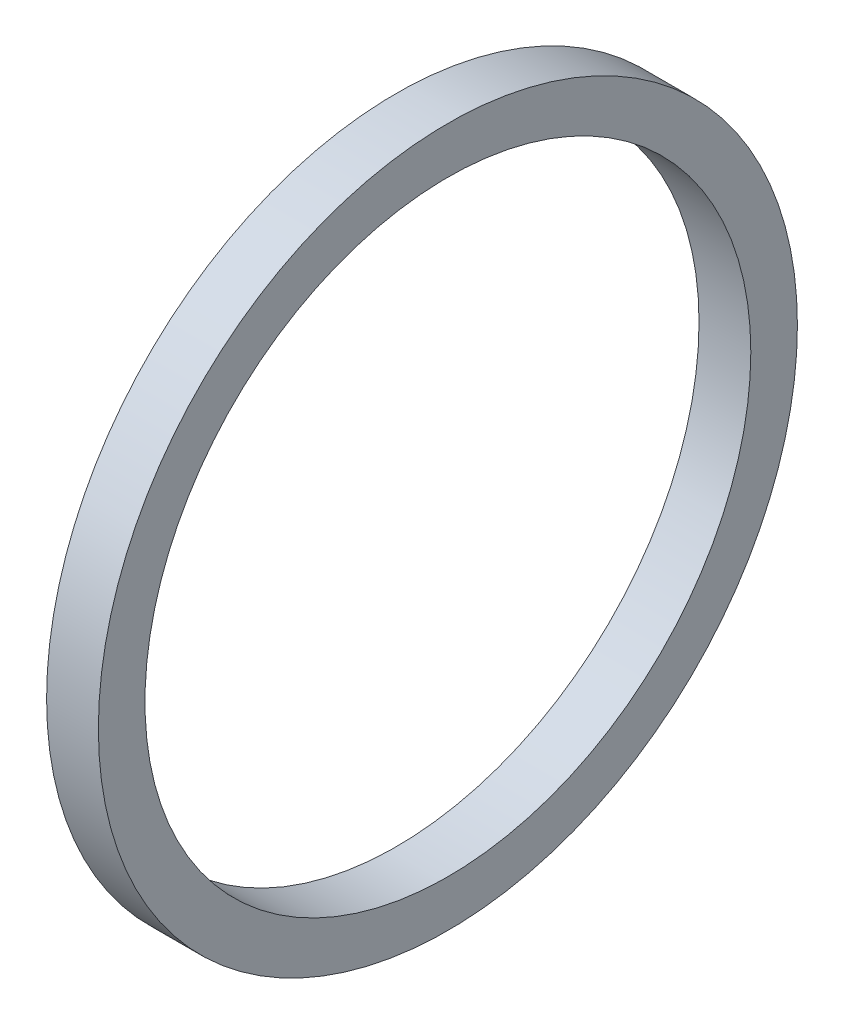
ISO-10303-21;
HEADER;
FILE_DESCRIPTION(('STEP AP214'),'2;1');
FILE_NAME('part.step','',(''),(''),'','','');
FILE_SCHEMA(('AUTOMOTIVE_DESIGN { 1 0 10303 214 1 1 1 1 }'));
ENDSEC;
DATA;
#1=APPLICATION_CONTEXT('core data for automotive mechanical design processes');
#2=APPLICATION_PROTOCOL_DEFINITION('international standard','automotive_design',2000,#1);
#3=PRODUCT_CONTEXT('',#1,'mechanical');
#4=PRODUCT('Part','Part','',(#3));
#5=PRODUCT_RELATED_PRODUCT_CATEGORY('part','',(#4));
#6=PRODUCT_DEFINITION_FORMATION('','',#4);
#7=PRODUCT_DEFINITION_CONTEXT('part definition',#1,'design');
#8=PRODUCT_DEFINITION('design','',#6,#7);
#9=PRODUCT_DEFINITION_SHAPE('','',#8);
#10=(LENGTH_UNIT() NAMED_UNIT(*) SI_UNIT(.MILLI.,.METRE.));
#11=(NAMED_UNIT(*) PLANE_ANGLE_UNIT() SI_UNIT($,.RADIAN.));
#12=(NAMED_UNIT(*) SI_UNIT($,.STERADIAN.) SOLID_ANGLE_UNIT());
#13=UNCERTAINTY_MEASURE_WITH_UNIT(LENGTH_MEASURE(1.E-05),#10,'distance_accuracy_value','');
#14=(GEOMETRIC_REPRESENTATION_CONTEXT(3) GLOBAL_UNCERTAINTY_ASSIGNED_CONTEXT((#13)) GLOBAL_UNIT_ASSIGNED_CONTEXT((#10,
#11,#12)) REPRESENTATION_CONTEXT('',''));
#15=CARTESIAN_POINT('',(0.,0.,0.));
#16=DIRECTION('',(0.,0.,1.));
#17=DIRECTION('',(1.,0.,0.));
#18=AXIS2_PLACEMENT_3D('',#15,#16,#17);
#19=CARTESIAN_POINT('',(0.254,0.156651527152158,1.47761940601797));
#20=DIRECTION('',(1.,0.,0.));
#21=DIRECTION('',(0.,0.,-1.));
#22=AXIS2_PLACEMENT_3D('',#19,#20,#21);
#23=PLANE('',#22);
#24=CARTESIAN_POINT('',(0.254,0.156651527152158,1.47761940601797));
#25=DIRECTION('',(1.,0.,0.));
#26=DIRECTION('',(0.,0.,-1.));
#27=AXIS2_PLACEMENT_3D('',#24,#25,#26);
#28=CIRCLE('',#27,1.7145);
#29=CARTESIAN_POINT('',(0.254,0.156651527152158,-0.236880593982031));
#30=VERTEX_POINT('',#29);
#31=EDGE_CURVE('E10',#30,#30,#28,.T.);
#32=ORIENTED_EDGE('',*,*,#31,.T.);
#33=EDGE_LOOP('',(#32));
#34=FACE_BOUND('',#33,.T.);
#35=CARTESIAN_POINT('',(0.254,0.156651527152158,1.47761940601797));
#36=DIRECTION('',(1.,0.,0.));
#37=DIRECTION('',(0.,0.,-1.));
#38=AXIS2_PLACEMENT_3D('',#35,#36,#37);
#39=CIRCLE('',#38,1.4859);
#40=CARTESIAN_POINT('',(0.254,0.156651527152158,-0.00828059398202984));
#41=VERTEX_POINT('',#40);
#42=EDGE_CURVE('E39',#41,#41,#39,.T.);
#43=ORIENTED_EDGE('',*,*,#42,.F.);
#44=EDGE_LOOP('',(#43));
#45=FACE_BOUND('',#44,.T.);
#46=ADVANCED_FACE('F28',(#34,#45),#23,.T.);
#47=CARTESIAN_POINT('',(0.,0.156651527152158,1.47761940601797));
#48=DIRECTION('',(1.,0.,0.));
#49=DIRECTION('',(0.,0.,-1.));
#50=AXIS2_PLACEMENT_3D('',#47,#48,#49);
#51=PLANE('',#50);
#52=CARTESIAN_POINT('',(0.,0.156651527152158,1.47761940601797));
#53=DIRECTION('',(1.,0.,0.));
#54=DIRECTION('',(0.,0.,-1.));
#55=AXIS2_PLACEMENT_3D('',#52,#53,#54);
#56=CIRCLE('',#55,1.7145);
#57=CARTESIAN_POINT('',(0.,0.156651527152158,-0.236880593982031));
#58=VERTEX_POINT('',#57);
#59=EDGE_CURVE('E32',#58,#58,#56,.T.);
#60=ORIENTED_EDGE('',*,*,#59,.F.);
#61=EDGE_LOOP('',(#60));
#62=FACE_BOUND('',#61,.T.);
#63=CARTESIAN_POINT('',(0.,0.156651527152158,1.47761940601797));
#64=DIRECTION('',(1.,0.,0.));
#65=DIRECTION('',(0.,0.,-1.));
#66=AXIS2_PLACEMENT_3D('',#63,#64,#65);
#67=CIRCLE('',#66,1.4859);
#68=CARTESIAN_POINT('',(0.,0.156651527152158,-0.00828059398202984));
#69=VERTEX_POINT('',#68);
#70=EDGE_CURVE('E41',#69,#69,#67,.T.);
#71=ORIENTED_EDGE('',*,*,#70,.T.);
#72=EDGE_LOOP('',(#71));
#73=FACE_BOUND('',#72,.T.);
#74=ADVANCED_FACE('F51',(#62,#73),#51,.F.);
#75=CARTESIAN_POINT('',(0.254,0.156651527152158,1.47761940601797));
#76=DIRECTION('',(-1.,0.,0.));
#77=DIRECTION('',(0.,0.,1.));
#78=AXIS2_PLACEMENT_3D('',#75,#76,#77);
#79=CYLINDRICAL_SURFACE('',#78,1.7145);
#80=ORIENTED_EDGE('',*,*,#31,.F.);
#81=EDGE_LOOP('',(#80));
#82=FACE_BOUND('',#81,.T.);
#83=ORIENTED_EDGE('',*,*,#59,.T.);
#84=EDGE_LOOP('',(#83));
#85=FACE_BOUND('',#84,.T.);
#86=ADVANCED_FACE('F30',(#82,#85),#79,.T.);
#87=CARTESIAN_POINT('',(0.254,0.156651527152158,1.47761940601797));
#88=DIRECTION('',(-1.,0.,0.));
#89=DIRECTION('',(0.,0.,1.));
#90=AXIS2_PLACEMENT_3D('',#87,#88,#89);
#91=CYLINDRICAL_SURFACE('',#90,1.4859);
#92=ORIENTED_EDGE('',*,*,#42,.T.);
#93=EDGE_LOOP('',(#92));
#94=FACE_BOUND('',#93,.T.);
#95=ORIENTED_EDGE('',*,*,#70,.F.);
#96=EDGE_LOOP('',(#95));
#97=FACE_BOUND('',#96,.T.);
#98=ADVANCED_FACE('F47',(#94,#97),#91,.F.);
#99=CLOSED_SHELL('',(#46,#74,#86,#98));
#100=MANIFOLD_SOLID_BREP('B2',#99);
#101=ADVANCED_BREP_SHAPE_REPRESENTATION('',(#18,#100),#14);
#102=SHAPE_DEFINITION_REPRESENTATION(#9,#101);
ENDSEC;
END-ISO-10303-21;
